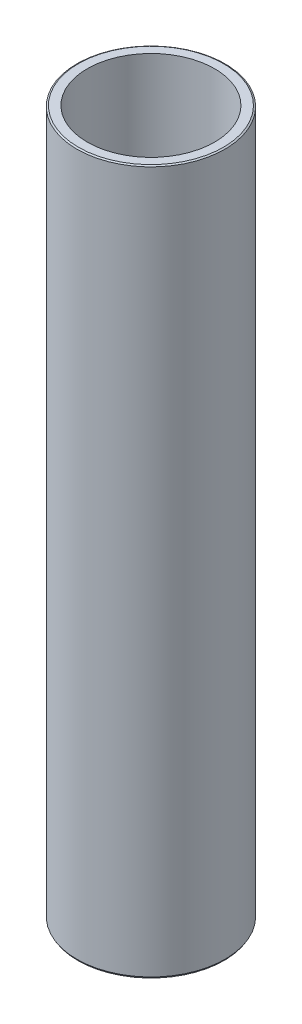
ISO-10303-21;
HEADER;
FILE_DESCRIPTION(('STEP AP214'),'2;1');
FILE_NAME('part.step','',(''),(''),'','','');
FILE_SCHEMA(('AUTOMOTIVE_DESIGN { 1 0 10303 214 1 1 1 1 }'));
ENDSEC;
DATA;
#1=APPLICATION_CONTEXT('core data for automotive mechanical design processes');
#2=APPLICATION_PROTOCOL_DEFINITION('international standard','automotive_design',2000,#1);
#3=PRODUCT_CONTEXT('',#1,'mechanical');
#4=PRODUCT('Part','Part','',(#3));
#5=PRODUCT_RELATED_PRODUCT_CATEGORY('part','',(#4));
#6=PRODUCT_DEFINITION_FORMATION('','',#4);
#7=PRODUCT_DEFINITION_CONTEXT('part definition',#1,'design');
#8=PRODUCT_DEFINITION('design','',#6,#7);
#9=PRODUCT_DEFINITION_SHAPE('','',#8);
#10=(LENGTH_UNIT() NAMED_UNIT(*) SI_UNIT(.MILLI.,.METRE.));
#11=(NAMED_UNIT(*) PLANE_ANGLE_UNIT() SI_UNIT($,.RADIAN.));
#12=(NAMED_UNIT(*) SI_UNIT($,.STERADIAN.) SOLID_ANGLE_UNIT());
#13=UNCERTAINTY_MEASURE_WITH_UNIT(LENGTH_MEASURE(1.E-05),#10,'distance_accuracy_value','');
#14=(GEOMETRIC_REPRESENTATION_CONTEXT(3) GLOBAL_UNCERTAINTY_ASSIGNED_CONTEXT((#13)) GLOBAL_UNIT_ASSIGNED_CONTEXT((#10,
#11,#12)) REPRESENTATION_CONTEXT('',''));
#15=CARTESIAN_POINT('',(0.,0.,0.));
#16=DIRECTION('',(0.,0.,1.));
#17=DIRECTION('',(1.,0.,0.));
#18=AXIS2_PLACEMENT_3D('',#15,#16,#17);
#19=CARTESIAN_POINT('',(0.,570.494041373414,0.));
#20=DIRECTION('',(0.,-1.,0.));
#21=DIRECTION('',(0.,0.,-1.));
#22=AXIS2_PLACEMENT_3D('',#19,#20,#21);
#23=CYLINDRICAL_SURFACE('',#22,60.);
#24=CARTESIAN_POINT('',(0.,569.776174426808,0.));
#25=DIRECTION('',(0.,1.,0.));
#26=DIRECTION('',(0.,0.,1.));
#27=AXIS2_PLACEMENT_3D('',#24,#25,#26);
#28=CIRCLE('',#27,60.);
#29=CARTESIAN_POINT('',(0.,569.776174426808,60.));
#30=VERTEX_POINT('',#29);
#31=EDGE_CURVE('E50',#30,#30,#28,.F.);
#32=ORIENTED_EDGE('',*,*,#31,.T.);
#33=EDGE_LOOP('',(#32));
#34=FACE_BOUND('',#33,.T.);
#35=CARTESIAN_POINT('',(0.,1.24338202459662,0.));
#36=DIRECTION('',(0.,1.,0.));
#37=DIRECTION('',(0.,0.,1.));
#38=AXIS2_PLACEMENT_3D('',#35,#36,#37);
#39=CIRCLE('',#38,60.);
#40=CARTESIAN_POINT('',(0.,1.24338202459662,60.));
#41=VERTEX_POINT('',#40);
#42=EDGE_CURVE('E51',#41,#41,#39,.T.);
#43=ORIENTED_EDGE('',*,*,#42,.T.);
#44=EDGE_LOOP('',(#43));
#45=FACE_BOUND('',#44,.T.);
#46=ADVANCED_FACE('F39',(#34,#45),#23,.T.);
#47=CARTESIAN_POINT('',(0.,570.494041373414,0.));
#48=DIRECTION('',(0.,1.,0.));
#49=DIRECTION('',(0.,0.,1.));
#50=AXIS2_PLACEMENT_3D('',#47,#48,#49);
#51=PLANE('',#50);
#52=CARTESIAN_POINT('',(0.,570.494041373414,0.));
#53=DIRECTION('',(0.,1.,0.));
#54=DIRECTION('',(0.,0.,1.));
#55=AXIS2_PLACEMENT_3D('',#52,#53,#54);
#56=CIRCLE('',#55,58.7566179754033);
#57=CARTESIAN_POINT('',(0.,570.494041373414,58.7566179754033));
#58=VERTEX_POINT('',#57);
#59=EDGE_CURVE('E54',#58,#58,#56,.T.);
#60=ORIENTED_EDGE('',*,*,#59,.T.);
#61=EDGE_LOOP('',(#60));
#62=FACE_BOUND('',#61,.T.);
#63=CARTESIAN_POINT('',(0.,570.494041373414,0.));
#64=DIRECTION('',(0.,1.,0.));
#65=DIRECTION('',(0.,0.,1.));
#66=AXIS2_PLACEMENT_3D('',#63,#64,#65);
#67=CIRCLE('',#66,51.593794562266);
#68=CARTESIAN_POINT('',(0.,570.494041373414,51.593794562266));
#69=VERTEX_POINT('',#68);
#70=EDGE_CURVE('E58',#69,#69,#67,.T.);
#71=ORIENTED_EDGE('',*,*,#70,.F.);
#72=EDGE_LOOP('',(#71));
#73=FACE_BOUND('',#72,.T.);
#74=ADVANCED_FACE('F69',(#62,#73),#51,.T.);
#75=CARTESIAN_POINT('',(0.,0.,0.));
#76=DIRECTION('',(0.,1.,0.));
#77=DIRECTION('',(0.,0.,1.));
#78=AXIS2_PLACEMENT_3D('',#75,#76,#77);
#79=PLANE('',#78);
#80=CARTESIAN_POINT('',(0.,0.,0.));
#81=DIRECTION('',(0.,1.,0.));
#82=DIRECTION('',(0.,0.,1.));
#83=AXIS2_PLACEMENT_3D('',#80,#81,#82);
#84=CIRCLE('',#83,59.2821330533936);
#85=CARTESIAN_POINT('',(0.,0.,59.2821330533936));
#86=VERTEX_POINT('',#85);
#87=EDGE_CURVE('E10',#86,#86,#84,.F.);
#88=ORIENTED_EDGE('',*,*,#87,.T.);
#89=EDGE_LOOP('',(#88));
#90=FACE_BOUND('',#89,.T.);
#91=CARTESIAN_POINT('',(0.,0.,0.));
#92=DIRECTION('',(0.,1.,0.));
#93=DIRECTION('',(0.,0.,1.));
#94=AXIS2_PLACEMENT_3D('',#91,#92,#93);
#95=CIRCLE('',#94,51.593794562266);
#96=CARTESIAN_POINT('',(0.,0.,51.593794562266));
#97=VERTEX_POINT('',#96);
#98=EDGE_CURVE('E63',#97,#97,#95,.T.);
#99=ORIENTED_EDGE('',*,*,#98,.T.);
#100=EDGE_LOOP('',(#99));
#101=FACE_BOUND('',#100,.T.);
#102=ADVANCED_FACE('F75',(#90,#101),#79,.F.);
#103=CARTESIAN_POINT('',(0.,570.494041373414,0.));
#104=DIRECTION('',(0.,-1.,0.));
#105=DIRECTION('',(0.,0.,-1.));
#106=AXIS2_PLACEMENT_3D('',#103,#104,#105);
#107=CYLINDRICAL_SURFACE('',#106,51.593794562266);
#108=ORIENTED_EDGE('',*,*,#70,.T.);
#109=EDGE_LOOP('',(#108));
#110=FACE_BOUND('',#109,.T.);
#111=ORIENTED_EDGE('',*,*,#98,.F.);
#112=EDGE_LOOP('',(#111));
#113=FACE_BOUND('',#112,.T.);
#114=ADVANCED_FACE('F70',(#110,#113),#107,.F.);
#115=CARTESIAN_POINT('',(0.,570.494041373414,0.));
#116=DIRECTION('',(0.,-1.,0.));
#117=DIRECTION('',(0.,0.,-1.));
#118=AXIS2_PLACEMENT_3D('',#115,#116,#117);
#119=CONICAL_SURFACE('',#118,58.7566179754033,1.04719755119657);
#120=ORIENTED_EDGE('',*,*,#31,.F.);
#121=EDGE_LOOP('',(#120));
#122=FACE_BOUND('',#121,.T.);
#123=ORIENTED_EDGE('',*,*,#59,.F.);
#124=EDGE_LOOP('',(#123));
#125=FACE_BOUND('',#124,.T.);
#126=ADVANCED_FACE('F81',(#122,#125),#119,.T.);
#127=CARTESIAN_POINT('',(0.,1.24338202459662,0.));
#128=DIRECTION('',(0.,1.,0.));
#129=DIRECTION('',(0.,0.,1.));
#130=AXIS2_PLACEMENT_3D('',#127,#128,#129);
#131=CONICAL_SURFACE('',#130,60.,0.523598775598309);
#132=CARTESIAN_POINT('',(0.,0.,59.2821330533936));
#133=CARTESIAN_POINT('',(0.,0.0129518960895472,59.2896108340874));
#134=CARTESIAN_POINT('',(0.,0.0259037921790956,59.2970886147812));
#135=CARTESIAN_POINT('',(0.,0.0518075843581925,59.3120441761688));
#136=CARTESIAN_POINT('',(0.,0.064759480447741,59.3195219568627));
#137=CARTESIAN_POINT('',(0.,0.0906632726268368,59.3344775182503));
#138=CARTESIAN_POINT('',(0.,0.103615168716384,59.3419552989441));
#139=CARTESIAN_POINT('',(0.,0.12951896089548,59.3569108603318));
#140=CARTESIAN_POINT('',(0.,0.142470856985029,59.3643886410256));
#141=CARTESIAN_POINT('',(0.,0.168374649164125,59.3793442024132));
#142=CARTESIAN_POINT('',(0.,0.181326545253673,59.386821983107));
#143=CARTESIAN_POINT('',(0.,0.20723033743277,59.4017775444946));
#144=CARTESIAN_POINT('',(0.,0.220182233522318,59.4092553251885));
#145=CARTESIAN_POINT('',(0.,0.246086025701414,59.4242108865761));
#146=CARTESIAN_POINT('',(0.,0.259037921790961,59.4316886672699));
#147=CARTESIAN_POINT('',(0.,0.284941713970057,59.4466442286576));
#148=CARTESIAN_POINT('',(0.,0.297893610059606,59.4541220093514));
#149=CARTESIAN_POINT('',(0.,0.323797402238702,59.469077570739));
#150=CARTESIAN_POINT('',(0.,0.33674929832825,59.4765553514328));
#151=CARTESIAN_POINT('',(0.,0.362653090507347,59.4915109128205));
#152=CARTESIAN_POINT('',(0.,0.375604986596895,59.4989886935143));
#153=CARTESIAN_POINT('',(0.,0.401508778775991,59.5139442549019));
#154=CARTESIAN_POINT('',(0.,0.414460674865539,59.5214220355957));
#155=CARTESIAN_POINT('',(0.,0.440364467044634,59.5363775969833));
#156=CARTESIAN_POINT('',(0.,0.453316363134183,59.5438553776772));
#157=CARTESIAN_POINT('',(0.,0.47922015531328,59.5588109390648));
#158=CARTESIAN_POINT('',(0.,0.492172051402827,59.5662887197586));
#159=CARTESIAN_POINT('',(0.,0.518075843581924,59.5812442811462));
#160=CARTESIAN_POINT('',(0.,0.531027739671473,59.5887220618401));
#161=CARTESIAN_POINT('',(0.,0.556931531850568,59.6036776232277));
#162=CARTESIAN_POINT('',(0.,0.569883427940116,59.6111554039215));
#163=CARTESIAN_POINT('',(0.,0.595787220119212,59.6261109653092));
#164=CARTESIAN_POINT('',(0.,0.60873911620876,59.633588746003));
#165=CARTESIAN_POINT('',(0.,0.634642908387857,59.6485443073906));
#166=CARTESIAN_POINT('',(0.,0.647594804477405,59.6560220880844));
#167=CARTESIAN_POINT('',(0.,0.673498596656501,59.6709776494721));
#168=CARTESIAN_POINT('',(0.,0.68645049274605,59.6784554301659));
#169=CARTESIAN_POINT('',(0.,0.712354284925146,59.6934109915535));
#170=CARTESIAN_POINT('',(0.,0.725306181014693,59.7008887722473));
#171=CARTESIAN_POINT('',(0.,0.751209973193789,59.715844333635));
#172=CARTESIAN_POINT('',(0.,0.764161869283338,59.7233221143288));
#173=CARTESIAN_POINT('',(0.,0.790065661462434,59.7382776757164));
#174=CARTESIAN_POINT('',(0.,0.803017557551982,59.7457554564102));
#175=CARTESIAN_POINT('',(0.,0.828921349731078,59.7607110177979));
#176=CARTESIAN_POINT('',(0.,0.841873245820627,59.7681887984917));
#177=CARTESIAN_POINT('',(0.,0.867777037999723,59.7831443598793));
#178=CARTESIAN_POINT('',(0.,0.88072893408927,59.7906221405731));
#179=CARTESIAN_POINT('',(0.,0.906632726268366,59.8055777019608));
#180=CARTESIAN_POINT('',(0.,0.919584622357915,59.8130554826546));
#181=CARTESIAN_POINT('',(0.,0.945488414537011,59.8280110440422));
#182=CARTESIAN_POINT('',(0.,0.958440310626559,59.835488824736));
#183=CARTESIAN_POINT('',(0.,0.984344102805656,59.8504443861237));
#184=CARTESIAN_POINT('',(0.,0.997295998895204,59.8579221668175));
#185=CARTESIAN_POINT('',(0.,1.0231997910743,59.8728777282051));
#186=CARTESIAN_POINT('',(0.,1.03615168716385,59.8803555088989));
#187=CARTESIAN_POINT('',(0.,1.06205547934294,59.8953110702866));
#188=CARTESIAN_POINT('',(0.,1.07500737543249,59.9027888509804));
#189=CARTESIAN_POINT('',(0.,1.10091116761159,59.917744412368));
#190=CARTESIAN_POINT('',(0.,1.11386306370114,59.9252221930618));
#191=CARTESIAN_POINT('',(0.,1.13976685588023,59.9401777544495));
#192=CARTESIAN_POINT('',(0.,1.15271875196978,59.9476555351433));
#193=CARTESIAN_POINT('',(0.,1.17862254414888,59.9626110965309));
#194=CARTESIAN_POINT('',(0.,1.19157444023843,59.9700888772247));
#195=CARTESIAN_POINT('',(0.,1.21747823241752,59.9850444386124));
#196=CARTESIAN_POINT('',(0.,1.23043012850707,59.9925222193062));
#197=CARTESIAN_POINT('',(0.,1.24338202459662,60.));
#198=B_SPLINE_CURVE_WITH_KNOTS('',3,(#132,#133,#134,#135,#136,#137,#138,#139,#140,#141,#142,
#143,#144,#145,#146,#147,#148,#149,#150,#151,#152,#153,#154,#155,#156,#157,#158,#159,#160,#161,
#162,#163,#164,#165,#166,#167,#168,#169,#170,#171,#172,#173,#174,#175,#176,#177,#178,#179,#180,
#181,#182,#183,#184,#185,#186,#187,#188,#189,#190,#191,#192,#193,#194,#195,#196,#197),
.UNSPECIFIED.,.F.,.F.,(4,2,2,2,2,2,2,2,2,2,2,2,2,2,2,2,2,2,2,2,2,2,2,2,2,2,2,2,2,2,2,2,4),(0.,
0.0448666841628993,0.0897333683257987,0.134600052488701,0.179466736651601,0.2243334208145,
0.269200104977399,0.314066789140302,0.358933473303202,0.403800157466101,0.448666841629,
0.493533525791903,0.538400209954803,0.583266894117702,0.628133578280601,0.673000262443504,
0.717866946606403,0.762733630769303,0.807600314932202,0.852466999095105,0.897333683258004,
0.942200367420904,0.987067051583803,1.03193373574671,1.07680041990961,1.1216671040725,
1.1665337882354,1.21140047239831,1.25626715656121,1.3011338407241,1.346000524887,
1.39086720904991,1.43573389321281),.UNSPECIFIED.);
#199=EDGE_CURVE('BSEAM45',#86,#41,#198,.T.);
#200=ORIENTED_EDGE('',*,*,#87,.F.);
#201=ORIENTED_EDGE('',*,*,#42,.F.);
#202=ORIENTED_EDGE('',*,*,#199,.T.);
#203=ORIENTED_EDGE('',*,*,#199,.F.);
#204=EDGE_LOOP('',(#200,#202,#201,#203));
#205=FACE_BOUND('',#204,.T.);
#206=ADVANCED_FACE('F45',(#205),#131,.T.);
#207=CLOSED_SHELL('',(#46,#74,#102,#114,#126,#206));
#208=MANIFOLD_SOLID_BREP('B2',#207);
#209=ADVANCED_BREP_SHAPE_REPRESENTATION('',(#18,#208),#14);
#210=SHAPE_DEFINITION_REPRESENTATION(#9,#209);
ENDSEC;
END-ISO-10303-21;
